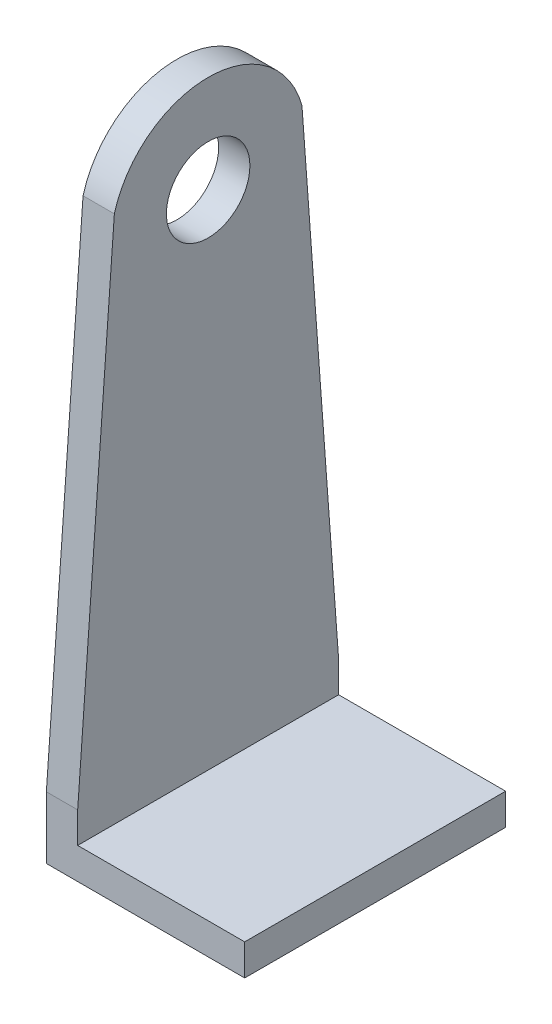
ISO-10303-21;
HEADER;
FILE_DESCRIPTION(('STEP AP214'),'2;1');
FILE_NAME('part.step','',(''),(''),'','','');
FILE_SCHEMA(('AUTOMOTIVE_DESIGN { 1 0 10303 214 1 1 1 1 }'));
ENDSEC;
DATA;
#1=APPLICATION_CONTEXT('core data for automotive mechanical design processes');
#2=APPLICATION_PROTOCOL_DEFINITION('international standard','automotive_design',2000,#1);
#3=PRODUCT_CONTEXT('',#1,'mechanical');
#4=PRODUCT('Part','Part','',(#3));
#5=PRODUCT_RELATED_PRODUCT_CATEGORY('part','',(#4));
#6=PRODUCT_DEFINITION_FORMATION('','',#4);
#7=PRODUCT_DEFINITION_CONTEXT('part definition',#1,'design');
#8=PRODUCT_DEFINITION('design','',#6,#7);
#9=PRODUCT_DEFINITION_SHAPE('','',#8);
#10=(LENGTH_UNIT() NAMED_UNIT(*) SI_UNIT(.MILLI.,.METRE.));
#11=(NAMED_UNIT(*) PLANE_ANGLE_UNIT() SI_UNIT($,.RADIAN.));
#12=(NAMED_UNIT(*) SI_UNIT($,.STERADIAN.) SOLID_ANGLE_UNIT());
#13=UNCERTAINTY_MEASURE_WITH_UNIT(LENGTH_MEASURE(1.E-05),#10,'distance_accuracy_value','');
#14=(GEOMETRIC_REPRESENTATION_CONTEXT(3) GLOBAL_UNCERTAINTY_ASSIGNED_CONTEXT((#13)) GLOBAL_UNIT_ASSIGNED_CONTEXT((#10,
#11,#12)) REPRESENTATION_CONTEXT('',''));
#15=CARTESIAN_POINT('',(0.,0.,0.));
#16=DIRECTION('',(0.,0.,1.));
#17=DIRECTION('',(1.,0.,0.));
#18=AXIS2_PLACEMENT_3D('',#15,#16,#17);
#19=CARTESIAN_POINT('',(15.5,-52.,0.));
#20=DIRECTION('',(-1.,0.,0.));
#21=DIRECTION('',(0.,0.,1.));
#22=AXIS2_PLACEMENT_3D('',#19,#20,#21);
#23=CYLINDRICAL_SURFACE('',#22,4.);
#24=CARTESIAN_POINT('',(16.5,-52.,0.));
#25=DIRECTION('',(-1.,0.,0.));
#26=DIRECTION('',(0.,0.,-1.));
#27=AXIS2_PLACEMENT_3D('',#24,#25,#26);
#28=CIRCLE('',#27,4.);
#29=CARTESIAN_POINT('',(16.5,-52.,-4.));
#30=VERTEX_POINT('',#29);
#31=EDGE_CURVE('E48',#30,#30,#28,.T.);
#32=ORIENTED_EDGE('',*,*,#31,.F.);
#33=EDGE_LOOP('',(#32));
#34=FACE_BOUND('',#33,.T.);
#35=CARTESIAN_POINT('',(13.5,-52.,0.));
#36=DIRECTION('',(1.,0.,0.));
#37=DIRECTION('',(0.,0.,-1.));
#38=AXIS2_PLACEMENT_3D('',#35,#36,#37);
#39=CIRCLE('',#38,4.);
#40=CARTESIAN_POINT('',(13.5,-52.,-4.));
#41=VERTEX_POINT('',#40);
#42=EDGE_CURVE('E167',#41,#41,#39,.T.);
#43=ORIENTED_EDGE('',*,*,#42,.F.);
#44=EDGE_LOOP('',(#43));
#45=FACE_BOUND('',#44,.T.);
#46=ADVANCED_FACE('F39',(#34,#45),#23,.F.);
#47=CARTESIAN_POINT('',(16.5,-100.7,-12.5));
#48=DIRECTION('',(1.,0.,0.));
#49=DIRECTION('',(0.,-1.,0.));
#50=AXIS2_PLACEMENT_3D('',#47,#48,#49);
#51=PLANE('',#50);
#52=DIRECTION('',(0.,-0.997297605701587,-0.0734675823876265));
#53=VECTOR('',#52,1.);
#54=CARTESIAN_POINT('',(16.5,-100.681108800183,-12.7564416540415));
#55=LINE('',#54,#53);
#56=CARTESIAN_POINT('',(16.5,-49.5,-8.986100377806));
#57=VERTEX_POINT('',#56);
#58=CARTESIAN_POINT('',(16.5,-97.2,-12.5));
#59=VERTEX_POINT('',#58);
#60=EDGE_CURVE('E118',#57,#59,#55,.T.);
#61=ORIENTED_EDGE('',*,*,#60,.F.);
#62=CARTESIAN_POINT('',(16.5,-52.0000000000001,0.));
#63=DIRECTION('',(1.,0.,0.));
#64=DIRECTION('',(0.,0.,-1.));
#65=AXIS2_PLACEMENT_3D('',#62,#63,#64);
#66=CIRCLE('',#65,9.32737905308911);
#67=CARTESIAN_POINT('',(16.5,-49.5,8.986100377806));
#68=VERTEX_POINT('',#67);
#69=EDGE_CURVE('E158',#57,#68,#66,.T.);
#70=ORIENTED_EDGE('',*,*,#69,.T.);
#71=DIRECTION('',(0.,0.997297605701587,-0.0734675823876265));
#72=VECTOR('',#71,1.);
#73=CARTESIAN_POINT('',(16.5,-98.8493826998868,12.6215045124945));
#74=LINE('',#73,#72);
#75=CARTESIAN_POINT('',(16.5,-97.2,12.5));
#76=VERTEX_POINT('',#75);
#77=EDGE_CURVE('E152',#76,#68,#74,.T.);
#78=ORIENTED_EDGE('',*,*,#77,.F.);
#79=DIRECTION('',(0.,1.,0.));
#80=VECTOR('',#79,1.);
#81=CARTESIAN_POINT('',(16.5,-100.7,12.5));
#82=LINE('',#81,#80);
#83=CARTESIAN_POINT('',(16.5,-100.149489742783,12.5));
#84=VERTEX_POINT('',#83);
#85=EDGE_CURVE('E123',#84,#76,#82,.T.);
#86=ORIENTED_EDGE('',*,*,#85,.F.);
#87=DIRECTION('',(0.,0.,1.));
#88=VECTOR('',#87,1.);
#89=CARTESIAN_POINT('',(16.5,-100.149489742783,12.5));
#90=LINE('',#89,#88);
#91=CARTESIAN_POINT('',(16.5,-100.149489742783,-12.5));
#92=VERTEX_POINT('',#91);
#93=EDGE_CURVE('E116',#92,#84,#90,.T.);
#94=ORIENTED_EDGE('',*,*,#93,.F.);
#95=DIRECTION('',(0.,1.,0.));
#96=VECTOR('',#95,1.);
#97=CARTESIAN_POINT('',(16.5,-100.7,-12.5));
#98=LINE('',#97,#96);
#99=EDGE_CURVE('E11',#92,#59,#98,.T.);
#100=ORIENTED_EDGE('',*,*,#99,.T.);
#101=EDGE_LOOP('',(#61,#70,#78,#86,#94,#100));
#102=FACE_BOUND('',#101,.T.);
#103=ORIENTED_EDGE('',*,*,#31,.T.);
#104=EDGE_LOOP('',(#103));
#105=FACE_BOUND('',#104,.T.);
#106=ADVANCED_FACE('F200',(#102,#105),#51,.T.);
#107=CARTESIAN_POINT('',(15.5,-70.85,12.5));
#108=DIRECTION('',(0.,0.,-1.));
#109=DIRECTION('',(0.,-1.,0.));
#110=AXIS2_PLACEMENT_3D('',#107,#108,#109);
#111=PLANE('',#110);
#112=DIRECTION('',(-1.,0.,0.));
#113=VECTOR('',#112,1.);
#114=CARTESIAN_POINT('',(32.5,-100.149489742783,12.5));
#115=LINE('',#114,#113);
#116=CARTESIAN_POINT('',(32.5,-100.149489742783,12.5));
#117=VERTEX_POINT('',#116);
#118=EDGE_CURVE('E112',#117,#84,#115,.T.);
#119=ORIENTED_EDGE('',*,*,#118,.T.);
#120=ORIENTED_EDGE('',*,*,#85,.T.);
#121=DIRECTION('',(-1.,0.,0.));
#122=VECTOR('',#121,1.);
#123=CARTESIAN_POINT('',(16.5,-97.2,12.5));
#124=LINE('',#123,#122);
#125=CARTESIAN_POINT('',(13.5,-97.2,12.5));
#126=VERTEX_POINT('',#125);
#127=EDGE_CURVE('E125',#76,#126,#124,.T.);
#128=ORIENTED_EDGE('',*,*,#127,.T.);
#129=DIRECTION('',(0.,-1.,0.));
#130=VECTOR('',#129,1.);
#131=CARTESIAN_POINT('',(13.5,0.,12.5));
#132=LINE('',#131,#130);
#133=CARTESIAN_POINT('',(13.5,-103.149489742783,12.5));
#134=VERTEX_POINT('',#133);
#135=EDGE_CURVE('E144',#126,#134,#132,.T.);
#136=ORIENTED_EDGE('',*,*,#135,.T.);
#137=DIRECTION('',(-1.,0.,0.));
#138=VECTOR('',#137,1.);
#139=CARTESIAN_POINT('',(75.6884089130718,-103.149489742783,12.5));
#140=LINE('',#139,#138);
#141=CARTESIAN_POINT('',(32.5,-103.149489742783,12.5));
#142=VERTEX_POINT('',#141);
#143=EDGE_CURVE('E102',#142,#134,#140,.T.);
#144=ORIENTED_EDGE('',*,*,#143,.F.);
#145=DIRECTION('',(0.,-1.,0.));
#146=VECTOR('',#145,1.);
#147=CARTESIAN_POINT('',(32.5,-103.149489742783,12.5));
#148=LINE('',#147,#146);
#149=EDGE_CURVE('E107',#117,#142,#148,.T.);
#150=ORIENTED_EDGE('',*,*,#149,.F.);
#151=EDGE_LOOP('',(#119,#120,#128,#136,#144,#150));
#152=FACE_BOUND('',#151,.T.);
#153=ADVANCED_FACE('F177',(#152),#111,.F.);
#154=CARTESIAN_POINT('',(15.93933982822,-101.76066017178,-12.5));
#155=DIRECTION('',(0.,0.,-1.));
#156=DIRECTION('',(1.,0.,0.));
#157=AXIS2_PLACEMENT_3D('',#154,#155,#156);
#158=PLANE('',#157);
#159=DIRECTION('',(-1.,0.,0.));
#160=VECTOR('',#159,1.);
#161=CARTESIAN_POINT('',(75.6884089130718,-103.149489742783,-12.5));
#162=LINE('',#161,#160);
#163=CARTESIAN_POINT('',(32.5,-103.149489742783,-12.5));
#164=VERTEX_POINT('',#163);
#165=CARTESIAN_POINT('',(13.5,-103.149489742783,-12.5));
#166=VERTEX_POINT('',#165);
#167=EDGE_CURVE('E89',#164,#166,#162,.T.);
#168=ORIENTED_EDGE('',*,*,#167,.T.);
#169=DIRECTION('',(0.,1.,0.));
#170=VECTOR('',#169,1.);
#171=CARTESIAN_POINT('',(13.5,0.,-12.5));
#172=LINE('',#171,#170);
#173=CARTESIAN_POINT('',(13.5,-97.2,-12.5));
#174=VERTEX_POINT('',#173);
#175=EDGE_CURVE('E142',#166,#174,#172,.T.);
#176=ORIENTED_EDGE('',*,*,#175,.T.);
#177=DIRECTION('',(-1.,0.,0.));
#178=VECTOR('',#177,1.);
#179=CARTESIAN_POINT('',(16.5,-97.2,-12.5));
#180=LINE('',#179,#178);
#181=EDGE_CURVE('E132',#59,#174,#180,.T.);
#182=ORIENTED_EDGE('',*,*,#181,.F.);
#183=ORIENTED_EDGE('',*,*,#99,.F.);
#184=DIRECTION('',(-1.,0.,0.));
#185=VECTOR('',#184,1.);
#186=CARTESIAN_POINT('',(32.5,-100.149489742783,-12.5));
#187=LINE('',#186,#185);
#188=CARTESIAN_POINT('',(32.5,-100.149489742783,-12.5));
#189=VERTEX_POINT('',#188);
#190=EDGE_CURVE('E68',#189,#92,#187,.T.);
#191=ORIENTED_EDGE('',*,*,#190,.F.);
#192=DIRECTION('',(0.,1.,0.));
#193=VECTOR('',#192,1.);
#194=CARTESIAN_POINT('',(32.5,-100.149489742783,-12.5));
#195=LINE('',#194,#193);
#196=EDGE_CURVE('E105',#164,#189,#195,.T.);
#197=ORIENTED_EDGE('',*,*,#196,.F.);
#198=EDGE_LOOP('',(#168,#176,#182,#183,#191,#197));
#199=FACE_BOUND('',#198,.T.);
#200=ADVANCED_FACE('F109',(#199),#158,.T.);
#201=CARTESIAN_POINT('',(75.6884089130718,-103.149489742783,-12.5));
#202=DIRECTION('',(0.,-1.,0.));
#203=DIRECTION('',(0.,0.,-1.));
#204=AXIS2_PLACEMENT_3D('',#201,#202,#203);
#205=PLANE('',#204);
#206=ORIENTED_EDGE('',*,*,#143,.T.);
#207=DIRECTION('',(0.,0.,-1.));
#208=VECTOR('',#207,1.);
#209=CARTESIAN_POINT('',(13.5,-103.149489742783,-12.5));
#210=LINE('',#209,#208);
#211=EDGE_CURVE('E96',#134,#166,#210,.T.);
#212=ORIENTED_EDGE('',*,*,#211,.T.);
#213=ORIENTED_EDGE('',*,*,#167,.F.);
#214=DIRECTION('',(0.,0.,-1.));
#215=VECTOR('',#214,1.);
#216=CARTESIAN_POINT('',(32.5,-103.149489742783,-12.5));
#217=LINE('',#216,#215);
#218=EDGE_CURVE('E93',#142,#164,#217,.T.);
#219=ORIENTED_EDGE('',*,*,#218,.F.);
#220=EDGE_LOOP('',(#206,#212,#213,#219));
#221=FACE_BOUND('',#220,.T.);
#222=ADVANCED_FACE('F92',(#221),#205,.T.);
#223=CARTESIAN_POINT('',(32.5,-100.149489742783,12.5));
#224=DIRECTION('',(0.,-1.,0.));
#225=DIRECTION('',(0.,0.,-1.));
#226=AXIS2_PLACEMENT_3D('',#223,#224,#225);
#227=PLANE('',#226);
#228=ORIENTED_EDGE('',*,*,#93,.T.);
#229=ORIENTED_EDGE('',*,*,#118,.F.);
#230=DIRECTION('',(0.,0.,1.));
#231=VECTOR('',#230,1.);
#232=CARTESIAN_POINT('',(32.5,-100.149489742783,12.5));
#233=LINE('',#232,#231);
#234=EDGE_CURVE('E57',#189,#117,#233,.T.);
#235=ORIENTED_EDGE('',*,*,#234,.F.);
#236=ORIENTED_EDGE('',*,*,#190,.T.);
#237=EDGE_LOOP('',(#228,#229,#235,#236));
#238=FACE_BOUND('',#237,.T.);
#239=ADVANCED_FACE('F220',(#238),#227,.F.);
#240=CARTESIAN_POINT('',(32.5,0.,0.));
#241=DIRECTION('',(-1.,0.,0.));
#242=DIRECTION('',(0.,0.,1.));
#243=AXIS2_PLACEMENT_3D('',#240,#241,#242);
#244=PLANE('',#243);
#245=ORIENTED_EDGE('',*,*,#149,.T.);
#246=ORIENTED_EDGE('',*,*,#218,.T.);
#247=ORIENTED_EDGE('',*,*,#196,.T.);
#248=ORIENTED_EDGE('',*,*,#234,.T.);
#249=EDGE_LOOP('',(#245,#246,#247,#248));
#250=FACE_BOUND('',#249,.T.);
#251=ADVANCED_FACE('F104',(#250),#244,.F.);
#252=CARTESIAN_POINT('',(22.,-49.5,-8.986100377806));
#253=DIRECTION('',(0.,-0.0734675823876265,0.997297605701587));
#254=DIRECTION('',(0.,-0.997297605701587,-0.0734675823876265));
#255=AXIS2_PLACEMENT_3D('',#252,#253,#254);
#256=PLANE('',#255);
#257=ORIENTED_EDGE('',*,*,#60,.T.);
#258=ORIENTED_EDGE('',*,*,#181,.T.);
#259=DIRECTION('',(0.,0.997297605701587,0.0734675823876265));
#260=VECTOR('',#259,1.);
#261=CARTESIAN_POINT('',(13.5,0.391227443813302,-5.31078035127329));
#262=LINE('',#261,#260);
#263=CARTESIAN_POINT('',(13.5,-49.5,-8.986100377806));
#264=VERTEX_POINT('',#263);
#265=EDGE_CURVE('E139',#174,#264,#262,.T.);
#266=ORIENTED_EDGE('',*,*,#265,.T.);
#267=DIRECTION('',(1.,0.,0.));
#268=VECTOR('',#267,1.);
#269=CARTESIAN_POINT('',(14.5,-49.5,-8.986100377806));
#270=LINE('',#269,#268);
#271=EDGE_CURVE('E42',#264,#57,#270,.T.);
#272=ORIENTED_EDGE('',*,*,#271,.T.);
#273=EDGE_LOOP('',(#257,#258,#266,#272));
#274=FACE_BOUND('',#273,.T.);
#275=ADVANCED_FACE('F136',(#274),#256,.F.);
#276=CARTESIAN_POINT('',(22.,-49.5,8.986100377806));
#277=DIRECTION('',(0.,-0.0734675823876265,-0.997297605701587));
#278=DIRECTION('',(0.,0.997297605701587,-0.0734675823876265));
#279=AXIS2_PLACEMENT_3D('',#276,#277,#278);
#280=PLANE('',#279);
#281=ORIENTED_EDGE('',*,*,#77,.T.);
#282=DIRECTION('',(1.,0.,0.));
#283=VECTOR('',#282,1.);
#284=CARTESIAN_POINT('',(14.5,-49.5,8.986100377806));
#285=LINE('',#284,#283);
#286=CARTESIAN_POINT('',(13.5,-49.5,8.986100377806));
#287=VERTEX_POINT('',#286);
#288=EDGE_CURVE('E101',#287,#68,#285,.T.);
#289=ORIENTED_EDGE('',*,*,#288,.F.);
#290=DIRECTION('',(0.,-0.997297605701587,0.0734675823876265));
#291=VECTOR('',#290,1.);
#292=CARTESIAN_POINT('',(13.5,0.391227443813302,5.31078035127329));
#293=LINE('',#292,#291);
#294=EDGE_CURVE('E165',#287,#126,#293,.T.);
#295=ORIENTED_EDGE('',*,*,#294,.T.);
#296=ORIENTED_EDGE('',*,*,#127,.F.);
#297=EDGE_LOOP('',(#281,#289,#295,#296));
#298=FACE_BOUND('',#297,.T.);
#299=ADVANCED_FACE('F184',(#298),#280,.F.);
#300=CARTESIAN_POINT('',(13.5,-52.0000000000001,0.));
#301=DIRECTION('',(1.,0.,0.));
#302=DIRECTION('',(0.,0.,-1.));
#303=AXIS2_PLACEMENT_3D('',#300,#301,#302);
#304=CYLINDRICAL_SURFACE('',#303,9.32737905308911);
#305=ORIENTED_EDGE('',*,*,#69,.F.);
#306=ORIENTED_EDGE('',*,*,#271,.F.);
#307=CARTESIAN_POINT('',(13.5,-52.0000000000001,0.));
#308=DIRECTION('',(1.,0.,0.));
#309=DIRECTION('',(0.,0.,-1.));
#310=AXIS2_PLACEMENT_3D('',#307,#308,#309);
#311=CIRCLE('',#310,9.32737905308911);
#312=EDGE_CURVE('E151',#264,#287,#311,.T.);
#313=ORIENTED_EDGE('',*,*,#312,.T.);
#314=ORIENTED_EDGE('',*,*,#288,.T.);
#315=EDGE_LOOP('',(#305,#306,#313,#314));
#316=FACE_BOUND('',#315,.T.);
#317=ADVANCED_FACE('F187',(#316),#304,.T.);
#318=CARTESIAN_POINT('',(13.5,0.,0.));
#319=DIRECTION('',(1.,0.,0.));
#320=DIRECTION('',(0.,0.,-1.));
#321=AXIS2_PLACEMENT_3D('',#318,#319,#320);
#322=PLANE('',#321);
#323=ORIENTED_EDGE('',*,*,#312,.F.);
#324=ORIENTED_EDGE('',*,*,#265,.F.);
#325=ORIENTED_EDGE('',*,*,#175,.F.);
#326=ORIENTED_EDGE('',*,*,#211,.F.);
#327=ORIENTED_EDGE('',*,*,#135,.F.);
#328=ORIENTED_EDGE('',*,*,#294,.F.);
#329=EDGE_LOOP('',(#323,#324,#325,#326,#327,#328));
#330=FACE_BOUND('',#329,.T.);
#331=ORIENTED_EDGE('',*,*,#42,.T.);
#332=EDGE_LOOP('',(#331));
#333=FACE_BOUND('',#332,.T.);
#334=ADVANCED_FACE('F147',(#330,#333),#322,.F.);
#335=CLOSED_SHELL('',(#46,#106,#153,#200,#222,#239,#251,#275,#299,#317,#334));
#336=MANIFOLD_SOLID_BREP('B2',#335);
#337=ADVANCED_BREP_SHAPE_REPRESENTATION('',(#18,#336),#14);
#338=SHAPE_DEFINITION_REPRESENTATION(#9,#337);
ENDSEC;
END-ISO-10303-21;
